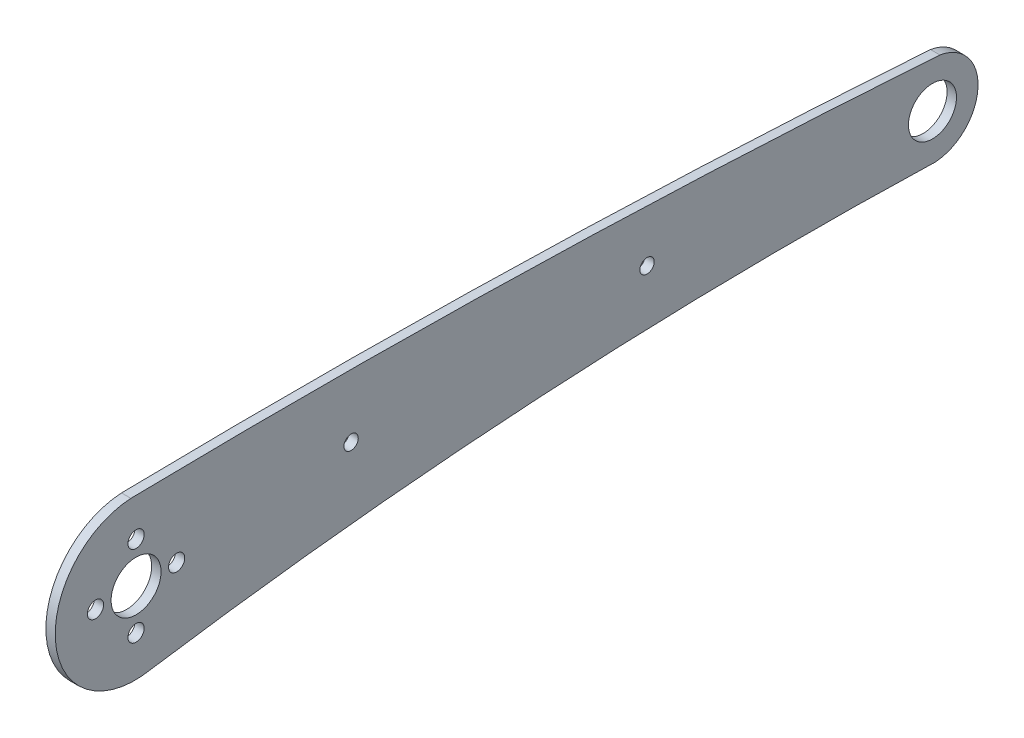
ISO-10303-21;
HEADER;
FILE_DESCRIPTION(('STEP AP214'),'2;1');
FILE_NAME('part.step','',(''),(''),'','','');
FILE_SCHEMA(('AUTOMOTIVE_DESIGN { 1 0 10303 214 1 1 1 1 }'));
ENDSEC;
DATA;
#1=APPLICATION_CONTEXT('core data for automotive mechanical design processes');
#2=APPLICATION_PROTOCOL_DEFINITION('international standard','automotive_design',2000,#1);
#3=PRODUCT_CONTEXT('',#1,'mechanical');
#4=PRODUCT('Part','Part','',(#3));
#5=PRODUCT_RELATED_PRODUCT_CATEGORY('part','',(#4));
#6=PRODUCT_DEFINITION_FORMATION('','',#4);
#7=PRODUCT_DEFINITION_CONTEXT('part definition',#1,'design');
#8=PRODUCT_DEFINITION('design','',#6,#7);
#9=PRODUCT_DEFINITION_SHAPE('','',#8);
#10=(LENGTH_UNIT() NAMED_UNIT(*) SI_UNIT(.MILLI.,.METRE.));
#11=(NAMED_UNIT(*) PLANE_ANGLE_UNIT() SI_UNIT($,.RADIAN.));
#12=(NAMED_UNIT(*) SI_UNIT($,.STERADIAN.) SOLID_ANGLE_UNIT());
#13=UNCERTAINTY_MEASURE_WITH_UNIT(LENGTH_MEASURE(1.E-05),#10,'distance_accuracy_value','');
#14=(GEOMETRIC_REPRESENTATION_CONTEXT(3) GLOBAL_UNCERTAINTY_ASSIGNED_CONTEXT((#13)) GLOBAL_UNIT_ASSIGNED_CONTEXT((#10,
#11,#12)) REPRESENTATION_CONTEXT('',''));
#15=CARTESIAN_POINT('',(0.,0.,0.));
#16=DIRECTION('',(0.,0.,1.));
#17=DIRECTION('',(1.,0.,0.));
#18=AXIS2_PLACEMENT_3D('',#15,#16,#17);
#19=CARTESIAN_POINT('',(1.5,0.0065204226326564,-66.7586301230406));
#20=DIRECTION('',(1.,0.,0.));
#21=DIRECTION('',(0.,0.,-1.));
#22=AXIS2_PLACEMENT_3D('',#19,#20,#21);
#23=PLANE('',#22);
#24=CARTESIAN_POINT('',(1.5,3.57117752441619,-20.8921029200437));
#25=DIRECTION('',(1.,0.,0.));
#26=DIRECTION('',(0.,0.,-1.));
#27=AXIS2_PLACEMENT_3D('',#24,#25,#26);
#28=CIRCLE('',#27,1.14903100774873);
#29=CARTESIAN_POINT('',(1.5,3.57117752441619,-22.0411339277924));
#30=VERTEX_POINT('',#29);
#31=EDGE_CURVE('E188',#30,#30,#28,.T.);
#32=ORIENTED_EDGE('',*,*,#31,.F.);
#33=EDGE_LOOP('',(#32));
#34=FACE_BOUND('',#33,.T.);
#35=CARTESIAN_POINT('',(1.5,2.1615708798249,-66.6171405395635));
#36=DIRECTION('',(1.,0.,0.));
#37=DIRECTION('',(0.,0.,-1.));
#38=AXIS2_PLACEMENT_3D('',#35,#36,#37);
#39=CIRCLE('',#38,3.85000000000001);
#40=CARTESIAN_POINT('',(1.5,2.1615708798249,-70.4671405395635));
#41=VERTEX_POINT('',#40);
#42=EDGE_CURVE('E200',#41,#41,#39,.T.);
#43=ORIENTED_EDGE('',*,*,#42,.F.);
#44=EDGE_LOOP('',(#43));
#45=FACE_BOUND('',#44,.T.);
#46=CARTESIAN_POINT('',(1.5,6.57958547922176,60.9696633130143));
#47=DIRECTION('',(1.,0.,0.));
#48=DIRECTION('',(0.,0.,-1.));
#49=AXIS2_PLACEMENT_3D('',#46,#47,#48);
#50=CIRCLE('',#49,1.3);
#51=CARTESIAN_POINT('',(1.5,6.57958547922176,59.6696633130143));
#52=VERTEX_POINT('',#51);
#53=EDGE_CURVE('E212',#52,#52,#50,.T.);
#54=ORIENTED_EDGE('',*,*,#53,.F.);
#55=EDGE_LOOP('',(#54));
#56=FACE_BOUND('',#55,.T.);
#57=CARTESIAN_POINT('',(1.5,0.0795854792217604,67.4696633130143));
#58=DIRECTION('',(1.,0.,0.));
#59=DIRECTION('',(0.,0.,-1.));
#60=AXIS2_PLACEMENT_3D('',#57,#58,#59);
#61=CIRCLE('',#60,1.29999999999999);
#62=CARTESIAN_POINT('',(1.5,0.0795854792217604,66.1696633130143));
#63=VERTEX_POINT('',#62);
#64=EDGE_CURVE('E112',#63,#63,#61,.T.);
#65=ORIENTED_EDGE('',*,*,#64,.F.);
#66=EDGE_LOOP('',(#65));
#67=FACE_BOUND('',#66,.T.);
#68=CARTESIAN_POINT('',(1.5,-2.14853003455959,-66.9001197065177));
#69=DIRECTION('',(1.,0.,0.));
#70=DIRECTION('',(0.,0.,-1.));
#71=AXIS2_PLACEMENT_3D('',#68,#69,#70);
#72=CIRCLE('',#71,2.9844961240227);
#73=CARTESIAN_POINT('',(1.5,-5.11662723586404,-66.5876839244522));
#74=VERTEX_POINT('',#73);
#75=CARTESIAN_POINT('',(1.5,-5.12661444963508,-67.095645487384));
#76=VERTEX_POINT('',#75);
#77=EDGE_CURVE('E117',#74,#76,#72,.T.);
#78=ORIENTED_EDGE('',*,*,#77,.T.);
#79=CARTESIAN_POINT('',(1.5,2.1615708798249,-66.6171405395635));
#80=DIRECTION('',(1.,0.,0.));
#81=DIRECTION('',(0.,0.,-1.));
#82=AXIS2_PLACEMENT_3D('',#79,#80,#81);
#83=CIRCLE('',#82,7.30387653110624);
#84=CARTESIAN_POINT('',(1.5,9.36927454105452,-67.7985042911333));
#85=VERTEX_POINT('',#84);
#86=EDGE_CURVE('E84',#76,#85,#83,.T.);
#87=ORIENTED_EDGE('',*,*,#86,.T.);
#88=CARTESIAN_POINT('',(1.5,-1440.36136953038,33.8038491519962));
#89=DIRECTION('',(1.,0.,0.));
#90=DIRECTION('',(0.,0.,-1.));
#91=AXIS2_PLACEMENT_3D('',#88,#89,#90);
#92=CIRCLE('',#91,1453.28661267658);
#93=CARTESIAN_POINT('',(1.5,12.6554814310781,61.8040171337543));
#94=VERTEX_POINT('',#93);
#95=EDGE_CURVE('E88',#85,#94,#92,.T.);
#96=ORIENTED_EDGE('',*,*,#95,.T.);
#97=CARTESIAN_POINT('',(1.5,-0.125777128901056,61.1215510533747));
#98=DIRECTION('',(1.,0.,0.));
#99=DIRECTION('',(0.,0.,-1.));
#100=AXIS2_PLACEMENT_3D('',#97,#98,#99);
#101=CIRCLE('',#100,12.7994660172957);
#102=CARTESIAN_POINT('',(1.5,-12.681082443716,58.6334516221455));
#103=VERTEX_POINT('',#102);
#104=EDGE_CURVE('E92',#94,#103,#101,.T.);
#105=ORIENTED_EDGE('',*,*,#104,.T.);
#106=CARTESIAN_POINT('',(1.5,-695.689726778049,-45.4653103386699));
#107=DIRECTION('',(-1.,0.,0.));
#108=DIRECTION('',(0.,0.,-1.));
#109=AXIS2_PLACEMENT_3D('',#106,#107,#108);
#110=CIRCLE('',#109,690.896056203245);
#111=EDGE_CURVE('E50',#103,#74,#110,.T.);
#112=ORIENTED_EDGE('',*,*,#111,.T.);
#113=EDGE_LOOP('',(#78,#87,#96,#105,#112));
#114=FACE_BOUND('',#113,.T.);
#115=CARTESIAN_POINT('',(1.5,0.0795854792217604,54.4696633130138));
#116=DIRECTION('',(1.,0.,0.));
#117=DIRECTION('',(0.,0.,1.));
#118=AXIS2_PLACEMENT_3D('',#115,#116,#117);
#119=CIRCLE('',#118,1.29999999999999);
#120=CARTESIAN_POINT('',(1.5,0.0795854792217604,55.7696633130138));
#121=VERTEX_POINT('',#120);
#122=EDGE_CURVE('E218',#121,#121,#119,.T.);
#123=ORIENTED_EDGE('',*,*,#122,.F.);
#124=EDGE_LOOP('',(#123));
#125=FACE_BOUND('',#124,.T.);
#126=CARTESIAN_POINT('',(1.5,-6.42041452077824,60.9696633130143));
#127=DIRECTION('',(1.,0.,0.));
#128=DIRECTION('',(0.,0.,1.));
#129=AXIS2_PLACEMENT_3D('',#126,#127,#128);
#130=CIRCLE('',#129,1.3);
#131=CARTESIAN_POINT('',(1.5,-6.42041452077824,62.2696633130143));
#132=VERTEX_POINT('',#131);
#133=EDGE_CURVE('E206',#132,#132,#130,.T.);
#134=ORIENTED_EDGE('',*,*,#133,.F.);
#135=EDGE_LOOP('',(#134));
#136=FACE_BOUND('',#135,.T.);
#137=CARTESIAN_POINT('',(1.5,0.0795854792217612,60.9696633130141));
#138=DIRECTION('',(1.,0.,0.));
#139=DIRECTION('',(0.,0.,-1.));
#140=AXIS2_PLACEMENT_3D('',#137,#138,#139);
#141=CIRCLE('',#140,4.00000000000001);
#142=CARTESIAN_POINT('',(1.5,0.0795854792217612,56.969663313014));
#143=VERTEX_POINT('',#142);
#144=EDGE_CURVE('E194',#143,#143,#141,.T.);
#145=ORIENTED_EDGE('',*,*,#144,.F.);
#146=EDGE_LOOP('',(#145));
#147=FACE_BOUND('',#146,.T.);
#148=CARTESIAN_POINT('',(1.5,2.79746673365068,26.5219120251684));
#149=DIRECTION('',(1.,0.,0.));
#150=DIRECTION('',(0.,0.,-1.));
#151=AXIS2_PLACEMENT_3D('',#148,#149,#150);
#152=CIRCLE('',#151,1.14903100774873);
#153=CARTESIAN_POINT('',(1.5,2.79746673365068,25.3728810174197));
#154=VERTEX_POINT('',#153);
#155=EDGE_CURVE('E179',#154,#154,#152,.T.);
#156=ORIENTED_EDGE('',*,*,#155,.F.);
#157=EDGE_LOOP('',(#156));
#158=FACE_BOUND('',#157,.T.);
#159=ADVANCED_FACE('F33',(#34,#45,#56,#67,#114,#125,#136,#147,#158),#23,.T.);
#160=CARTESIAN_POINT('',(0.,0.0065204226326564,-66.7586301230406));
#161=DIRECTION('',(1.,0.,0.));
#162=DIRECTION('',(0.,0.,-1.));
#163=AXIS2_PLACEMENT_3D('',#160,#161,#162);
#164=PLANE('',#163);
#165=CARTESIAN_POINT('',(0.,-2.14853003455959,-66.9001197065177));
#166=DIRECTION('',(1.,0.,0.));
#167=DIRECTION('',(0.,0.,-1.));
#168=AXIS2_PLACEMENT_3D('',#165,#166,#167);
#169=CIRCLE('',#168,2.9844961240227);
#170=CARTESIAN_POINT('',(0.,-5.11662723586404,-66.5876839244522));
#171=VERTEX_POINT('',#170);
#172=CARTESIAN_POINT('',(0.,-5.12661444963508,-67.095645487384));
#173=VERTEX_POINT('',#172);
#174=EDGE_CURVE('E108',#171,#173,#169,.T.);
#175=ORIENTED_EDGE('',*,*,#174,.F.);
#176=CARTESIAN_POINT('',(0.,-695.689726778049,-45.4653103386699));
#177=DIRECTION('',(-1.,0.,0.));
#178=DIRECTION('',(0.,0.,-1.));
#179=AXIS2_PLACEMENT_3D('',#176,#177,#178);
#180=CIRCLE('',#179,690.896056203245);
#181=CARTESIAN_POINT('',(0.,-12.681082443716,58.6334516221455));
#182=VERTEX_POINT('',#181);
#183=EDGE_CURVE('E76',#182,#171,#180,.T.);
#184=ORIENTED_EDGE('',*,*,#183,.F.);
#185=CARTESIAN_POINT('',(0.,-0.125777128901056,61.1215510533747));
#186=DIRECTION('',(1.,0.,0.));
#187=DIRECTION('',(0.,0.,-1.));
#188=AXIS2_PLACEMENT_3D('',#185,#186,#187);
#189=CIRCLE('',#188,12.7994660172957);
#190=CARTESIAN_POINT('',(0.,12.6554814310781,61.8040171337543));
#191=VERTEX_POINT('',#190);
#192=EDGE_CURVE('E70',#191,#182,#189,.T.);
#193=ORIENTED_EDGE('',*,*,#192,.F.);
#194=CARTESIAN_POINT('',(0.,-1440.36136953038,33.8038491519962));
#195=DIRECTION('',(1.,0.,0.));
#196=DIRECTION('',(0.,0.,-1.));
#197=AXIS2_PLACEMENT_3D('',#194,#195,#196);
#198=CIRCLE('',#197,1453.28661267658);
#199=CARTESIAN_POINT('',(0.,9.36927454105452,-67.7985042911333));
#200=VERTEX_POINT('',#199);
#201=EDGE_CURVE('E99',#200,#191,#198,.T.);
#202=ORIENTED_EDGE('',*,*,#201,.F.);
#203=CARTESIAN_POINT('',(0.,2.1615708798249,-66.6171405395635));
#204=DIRECTION('',(1.,0.,0.));
#205=DIRECTION('',(0.,0.,-1.));
#206=AXIS2_PLACEMENT_3D('',#203,#204,#205);
#207=CIRCLE('',#206,7.30387653110624);
#208=EDGE_CURVE('E111',#173,#200,#207,.T.);
#209=ORIENTED_EDGE('',*,*,#208,.F.);
#210=EDGE_LOOP('',(#175,#184,#193,#202,#209));
#211=FACE_BOUND('',#210,.T.);
#212=CARTESIAN_POINT('',(0.,0.0795854792217604,67.4696633130143));
#213=DIRECTION('',(1.,0.,0.));
#214=DIRECTION('',(0.,0.,-1.));
#215=AXIS2_PLACEMENT_3D('',#212,#213,#214);
#216=CIRCLE('',#215,1.29999999999999);
#217=CARTESIAN_POINT('',(0.,0.0795854792217604,66.1696633130143));
#218=VERTEX_POINT('',#217);
#219=EDGE_CURVE('E221',#218,#218,#216,.T.);
#220=ORIENTED_EDGE('',*,*,#219,.T.);
#221=EDGE_LOOP('',(#220));
#222=FACE_BOUND('',#221,.T.);
#223=CARTESIAN_POINT('',(0.,0.0795854792217604,54.4696633130138));
#224=DIRECTION('',(1.,0.,0.));
#225=DIRECTION('',(0.,0.,1.));
#226=AXIS2_PLACEMENT_3D('',#223,#224,#225);
#227=CIRCLE('',#226,1.29999999999999);
#228=CARTESIAN_POINT('',(0.,0.0795854792217604,55.7696633130138));
#229=VERTEX_POINT('',#228);
#230=EDGE_CURVE('E215',#229,#229,#227,.T.);
#231=ORIENTED_EDGE('',*,*,#230,.T.);
#232=EDGE_LOOP('',(#231));
#233=FACE_BOUND('',#232,.T.);
#234=CARTESIAN_POINT('',(0.,6.57958547922176,60.9696633130143));
#235=DIRECTION('',(1.,0.,0.));
#236=DIRECTION('',(0.,0.,-1.));
#237=AXIS2_PLACEMENT_3D('',#234,#235,#236);
#238=CIRCLE('',#237,1.3);
#239=CARTESIAN_POINT('',(0.,6.57958547922176,59.6696633130143));
#240=VERTEX_POINT('',#239);
#241=EDGE_CURVE('E209',#240,#240,#238,.T.);
#242=ORIENTED_EDGE('',*,*,#241,.T.);
#243=EDGE_LOOP('',(#242));
#244=FACE_BOUND('',#243,.T.);
#245=CARTESIAN_POINT('',(0.,-6.42041452077824,60.9696633130143));
#246=DIRECTION('',(1.,0.,0.));
#247=DIRECTION('',(0.,0.,1.));
#248=AXIS2_PLACEMENT_3D('',#245,#246,#247);
#249=CIRCLE('',#248,1.3);
#250=CARTESIAN_POINT('',(0.,-6.42041452077824,62.2696633130143));
#251=VERTEX_POINT('',#250);
#252=EDGE_CURVE('E203',#251,#251,#249,.T.);
#253=ORIENTED_EDGE('',*,*,#252,.T.);
#254=EDGE_LOOP('',(#253));
#255=FACE_BOUND('',#254,.T.);
#256=CARTESIAN_POINT('',(0.,2.1615708798249,-66.6171405395635));
#257=DIRECTION('',(1.,0.,0.));
#258=DIRECTION('',(0.,0.,-1.));
#259=AXIS2_PLACEMENT_3D('',#256,#257,#258);
#260=CIRCLE('',#259,3.85000000000001);
#261=CARTESIAN_POINT('',(0.,2.1615708798249,-70.4671405395635));
#262=VERTEX_POINT('',#261);
#263=EDGE_CURVE('E197',#262,#262,#260,.T.);
#264=ORIENTED_EDGE('',*,*,#263,.T.);
#265=EDGE_LOOP('',(#264));
#266=FACE_BOUND('',#265,.T.);
#267=CARTESIAN_POINT('',(0.,0.0795854792217612,60.9696633130141));
#268=DIRECTION('',(1.,0.,0.));
#269=DIRECTION('',(0.,0.,-1.));
#270=AXIS2_PLACEMENT_3D('',#267,#268,#269);
#271=CIRCLE('',#270,4.00000000000001);
#272=CARTESIAN_POINT('',(0.,0.0795854792217612,56.969663313014));
#273=VERTEX_POINT('',#272);
#274=EDGE_CURVE('E191',#273,#273,#271,.T.);
#275=ORIENTED_EDGE('',*,*,#274,.T.);
#276=EDGE_LOOP('',(#275));
#277=FACE_BOUND('',#276,.T.);
#278=CARTESIAN_POINT('',(0.,3.57117752441619,-20.8921029200437));
#279=DIRECTION('',(1.,0.,0.));
#280=DIRECTION('',(0.,0.,-1.));
#281=AXIS2_PLACEMENT_3D('',#278,#279,#280);
#282=CIRCLE('',#281,1.14903100774873);
#283=CARTESIAN_POINT('',(0.,3.57117752441619,-22.0411339277924));
#284=VERTEX_POINT('',#283);
#285=EDGE_CURVE('E185',#284,#284,#282,.T.);
#286=ORIENTED_EDGE('',*,*,#285,.T.);
#287=EDGE_LOOP('',(#286));
#288=FACE_BOUND('',#287,.T.);
#289=CARTESIAN_POINT('',(0.,2.79746673365068,26.5219120251684));
#290=DIRECTION('',(1.,0.,0.));
#291=DIRECTION('',(0.,0.,-1.));
#292=AXIS2_PLACEMENT_3D('',#289,#290,#291);
#293=CIRCLE('',#292,1.14903100774873);
#294=CARTESIAN_POINT('',(0.,2.79746673365068,25.3728810174197));
#295=VERTEX_POINT('',#294);
#296=EDGE_CURVE('E182',#295,#295,#293,.T.);
#297=ORIENTED_EDGE('',*,*,#296,.T.);
#298=EDGE_LOOP('',(#297));
#299=FACE_BOUND('',#298,.T.);
#300=ADVANCED_FACE('F121',(#211,#222,#233,#244,#255,#266,#277,#288,#299),#164,.F.);
#301=CARTESIAN_POINT('',(1.5,-2.14853003455959,-66.9001197065177));
#302=DIRECTION('',(-1.,0.,0.));
#303=DIRECTION('',(0.,0.,1.));
#304=AXIS2_PLACEMENT_3D('',#301,#302,#303);
#305=CYLINDRICAL_SURFACE('',#304,2.9844961240227);
#306=ORIENTED_EDGE('',*,*,#174,.T.);
#307=DIRECTION('',(-1.,0.,0.));
#308=VECTOR('',#307,1.);
#309=CARTESIAN_POINT('',(1.5,-5.12661444963508,-67.095645487384));
#310=LINE('',#309,#308);
#311=EDGE_CURVE('E11',#76,#173,#310,.T.);
#312=ORIENTED_EDGE('',*,*,#311,.F.);
#313=ORIENTED_EDGE('',*,*,#77,.F.);
#314=DIRECTION('',(-1.,0.,0.));
#315=VECTOR('',#314,1.);
#316=CARTESIAN_POINT('',(1.5,-5.11662723586404,-66.5876839244522));
#317=LINE('',#316,#315);
#318=EDGE_CURVE('E104',#74,#171,#317,.T.);
#319=ORIENTED_EDGE('',*,*,#318,.T.);
#320=EDGE_LOOP('',(#306,#312,#313,#319));
#321=FACE_BOUND('',#320,.T.);
#322=ADVANCED_FACE('F35',(#321),#305,.T.);
#323=CARTESIAN_POINT('',(1.5,2.1615708798249,-66.6171405395635));
#324=DIRECTION('',(-1.,0.,0.));
#325=DIRECTION('',(0.,0.,1.));
#326=AXIS2_PLACEMENT_3D('',#323,#324,#325);
#327=CYLINDRICAL_SURFACE('',#326,7.30387653110624);
#328=ORIENTED_EDGE('',*,*,#208,.T.);
#329=DIRECTION('',(-1.,0.,0.));
#330=VECTOR('',#329,1.);
#331=CARTESIAN_POINT('',(1.5,9.36927454105452,-67.7985042911333));
#332=LINE('',#331,#330);
#333=EDGE_CURVE('E42',#85,#200,#332,.T.);
#334=ORIENTED_EDGE('',*,*,#333,.F.);
#335=ORIENTED_EDGE('',*,*,#86,.F.);
#336=ORIENTED_EDGE('',*,*,#311,.T.);
#337=EDGE_LOOP('',(#328,#334,#335,#336));
#338=FACE_BOUND('',#337,.T.);
#339=ADVANCED_FACE('F306',(#338),#327,.T.);
#340=CARTESIAN_POINT('',(1.5,-1440.36136953038,33.8038491519962));
#341=DIRECTION('',(-1.,0.,0.));
#342=DIRECTION('',(0.,0.,1.));
#343=AXIS2_PLACEMENT_3D('',#340,#341,#342);
#344=CYLINDRICAL_SURFACE('',#343,1453.28661267658);
#345=ORIENTED_EDGE('',*,*,#201,.T.);
#346=DIRECTION('',(-1.,0.,0.));
#347=VECTOR('',#346,1.);
#348=CARTESIAN_POINT('',(1.5,12.6554814310781,61.8040171337543));
#349=LINE('',#348,#347);
#350=EDGE_CURVE('E96',#94,#191,#349,.T.);
#351=ORIENTED_EDGE('',*,*,#350,.F.);
#352=ORIENTED_EDGE('',*,*,#95,.F.);
#353=ORIENTED_EDGE('',*,*,#333,.T.);
#354=EDGE_LOOP('',(#345,#351,#352,#353));
#355=FACE_BOUND('',#354,.T.);
#356=ADVANCED_FACE('F97',(#355),#344,.T.);
#357=CARTESIAN_POINT('',(1.5,-0.125777128901056,61.1215510533747));
#358=DIRECTION('',(-1.,0.,0.));
#359=DIRECTION('',(0.,0.,1.));
#360=AXIS2_PLACEMENT_3D('',#357,#358,#359);
#361=CYLINDRICAL_SURFACE('',#360,12.7994660172957);
#362=ORIENTED_EDGE('',*,*,#192,.T.);
#363=DIRECTION('',(-1.,0.,0.));
#364=VECTOR('',#363,1.);
#365=CARTESIAN_POINT('',(1.5,-12.681082443716,58.6334516221455));
#366=LINE('',#365,#364);
#367=EDGE_CURVE('E100',#103,#182,#366,.T.);
#368=ORIENTED_EDGE('',*,*,#367,.F.);
#369=ORIENTED_EDGE('',*,*,#104,.F.);
#370=ORIENTED_EDGE('',*,*,#350,.T.);
#371=EDGE_LOOP('',(#362,#368,#369,#370));
#372=FACE_BOUND('',#371,.T.);
#373=ADVANCED_FACE('F102',(#372),#361,.T.);
#374=CARTESIAN_POINT('',(1.5,-695.689726778049,-45.4653103386699));
#375=DIRECTION('',(-1.,0.,0.));
#376=DIRECTION('',(0.,0.,1.));
#377=AXIS2_PLACEMENT_3D('',#374,#375,#376);
#378=CYLINDRICAL_SURFACE('',#377,690.896056203245);
#379=ORIENTED_EDGE('',*,*,#183,.T.);
#380=ORIENTED_EDGE('',*,*,#318,.F.);
#381=ORIENTED_EDGE('',*,*,#111,.F.);
#382=ORIENTED_EDGE('',*,*,#367,.T.);
#383=EDGE_LOOP('',(#379,#380,#381,#382));
#384=FACE_BOUND('',#383,.T.);
#385=ADVANCED_FACE('F126',(#384),#378,.F.);
#386=CARTESIAN_POINT('',(1.5,0.0795854792217604,67.4696633130143));
#387=DIRECTION('',(-1.,0.,0.));
#388=DIRECTION('',(0.,0.,1.));
#389=AXIS2_PLACEMENT_3D('',#386,#387,#388);
#390=CYLINDRICAL_SURFACE('',#389,1.29999999999999);
#391=ORIENTED_EDGE('',*,*,#64,.T.);
#392=EDGE_LOOP('',(#391));
#393=FACE_BOUND('',#392,.T.);
#394=ORIENTED_EDGE('',*,*,#219,.F.);
#395=EDGE_LOOP('',(#394));
#396=FACE_BOUND('',#395,.T.);
#397=ADVANCED_FACE('F128',(#393,#396),#390,.F.);
#398=CARTESIAN_POINT('',(1.5,0.0795854792217604,54.4696633130138));
#399=DIRECTION('',(-1.,0.,0.));
#400=DIRECTION('',(0.,0.,1.));
#401=AXIS2_PLACEMENT_3D('',#398,#399,#400);
#402=CYLINDRICAL_SURFACE('',#401,1.29999999999999);
#403=ORIENTED_EDGE('',*,*,#122,.T.);
#404=EDGE_LOOP('',(#403));
#405=FACE_BOUND('',#404,.T.);
#406=ORIENTED_EDGE('',*,*,#230,.F.);
#407=EDGE_LOOP('',(#406));
#408=FACE_BOUND('',#407,.T.);
#409=ADVANCED_FACE('F134',(#405,#408),#402,.F.);
#410=CARTESIAN_POINT('',(1.5,6.57958547922176,60.9696633130143));
#411=DIRECTION('',(-1.,0.,0.));
#412=DIRECTION('',(0.,0.,1.));
#413=AXIS2_PLACEMENT_3D('',#410,#411,#412);
#414=CYLINDRICAL_SURFACE('',#413,1.3);
#415=ORIENTED_EDGE('',*,*,#53,.T.);
#416=EDGE_LOOP('',(#415));
#417=FACE_BOUND('',#416,.T.);
#418=ORIENTED_EDGE('',*,*,#241,.F.);
#419=EDGE_LOOP('',(#418));
#420=FACE_BOUND('',#419,.T.);
#421=ADVANCED_FACE('F150',(#417,#420),#414,.F.);
#422=CARTESIAN_POINT('',(1.5,-6.42041452077824,60.9696633130143));
#423=DIRECTION('',(-1.,0.,0.));
#424=DIRECTION('',(0.,0.,1.));
#425=AXIS2_PLACEMENT_3D('',#422,#423,#424);
#426=CYLINDRICAL_SURFACE('',#425,1.3);
#427=ORIENTED_EDGE('',*,*,#133,.T.);
#428=EDGE_LOOP('',(#427));
#429=FACE_BOUND('',#428,.T.);
#430=ORIENTED_EDGE('',*,*,#252,.F.);
#431=EDGE_LOOP('',(#430));
#432=FACE_BOUND('',#431,.T.);
#433=ADVANCED_FACE('F154',(#429,#432),#426,.F.);
#434=CARTESIAN_POINT('',(1.5,2.1615708798249,-66.6171405395635));
#435=DIRECTION('',(-1.,0.,0.));
#436=DIRECTION('',(0.,0.,1.));
#437=AXIS2_PLACEMENT_3D('',#434,#435,#436);
#438=CYLINDRICAL_SURFACE('',#437,3.85000000000001);
#439=ORIENTED_EDGE('',*,*,#42,.T.);
#440=EDGE_LOOP('',(#439));
#441=FACE_BOUND('',#440,.T.);
#442=ORIENTED_EDGE('',*,*,#263,.F.);
#443=EDGE_LOOP('',(#442));
#444=FACE_BOUND('',#443,.T.);
#445=ADVANCED_FACE('F158',(#441,#444),#438,.F.);
#446=CARTESIAN_POINT('',(1.5,0.0795854792217612,60.9696633130141));
#447=DIRECTION('',(-1.,0.,0.));
#448=DIRECTION('',(0.,0.,1.));
#449=AXIS2_PLACEMENT_3D('',#446,#447,#448);
#450=CYLINDRICAL_SURFACE('',#449,4.00000000000001);
#451=ORIENTED_EDGE('',*,*,#144,.T.);
#452=EDGE_LOOP('',(#451));
#453=FACE_BOUND('',#452,.T.);
#454=ORIENTED_EDGE('',*,*,#274,.F.);
#455=EDGE_LOOP('',(#454));
#456=FACE_BOUND('',#455,.T.);
#457=ADVANCED_FACE('F162',(#453,#456),#450,.F.);
#458=CARTESIAN_POINT('',(1.5,3.57117752441619,-20.8921029200437));
#459=DIRECTION('',(-1.,0.,0.));
#460=DIRECTION('',(0.,0.,1.));
#461=AXIS2_PLACEMENT_3D('',#458,#459,#460);
#462=CYLINDRICAL_SURFACE('',#461,1.14903100774873);
#463=ORIENTED_EDGE('',*,*,#31,.T.);
#464=EDGE_LOOP('',(#463));
#465=FACE_BOUND('',#464,.T.);
#466=ORIENTED_EDGE('',*,*,#285,.F.);
#467=EDGE_LOOP('',(#466));
#468=FACE_BOUND('',#467,.T.);
#469=ADVANCED_FACE('F166',(#465,#468),#462,.F.);
#470=CARTESIAN_POINT('',(1.5,2.79746673365068,26.5219120251684));
#471=DIRECTION('',(-1.,0.,0.));
#472=DIRECTION('',(0.,0.,1.));
#473=AXIS2_PLACEMENT_3D('',#470,#471,#472);
#474=CYLINDRICAL_SURFACE('',#473,1.14903100774873);
#475=ORIENTED_EDGE('',*,*,#155,.T.);
#476=EDGE_LOOP('',(#475));
#477=FACE_BOUND('',#476,.T.);
#478=ORIENTED_EDGE('',*,*,#296,.F.);
#479=EDGE_LOOP('',(#478));
#480=FACE_BOUND('',#479,.T.);
#481=ADVANCED_FACE('F170',(#477,#480),#474,.F.);
#482=CLOSED_SHELL('',(#159,#300,#322,#339,#356,#373,#385,#397,#409,#421,#433,#445,#457,#469,#481));
#483=MANIFOLD_SOLID_BREP('B2',#482);
#484=ADVANCED_BREP_SHAPE_REPRESENTATION('',(#18,#483),#14);
#485=SHAPE_DEFINITION_REPRESENTATION(#9,#484);
ENDSEC;
END-ISO-10303-21;
